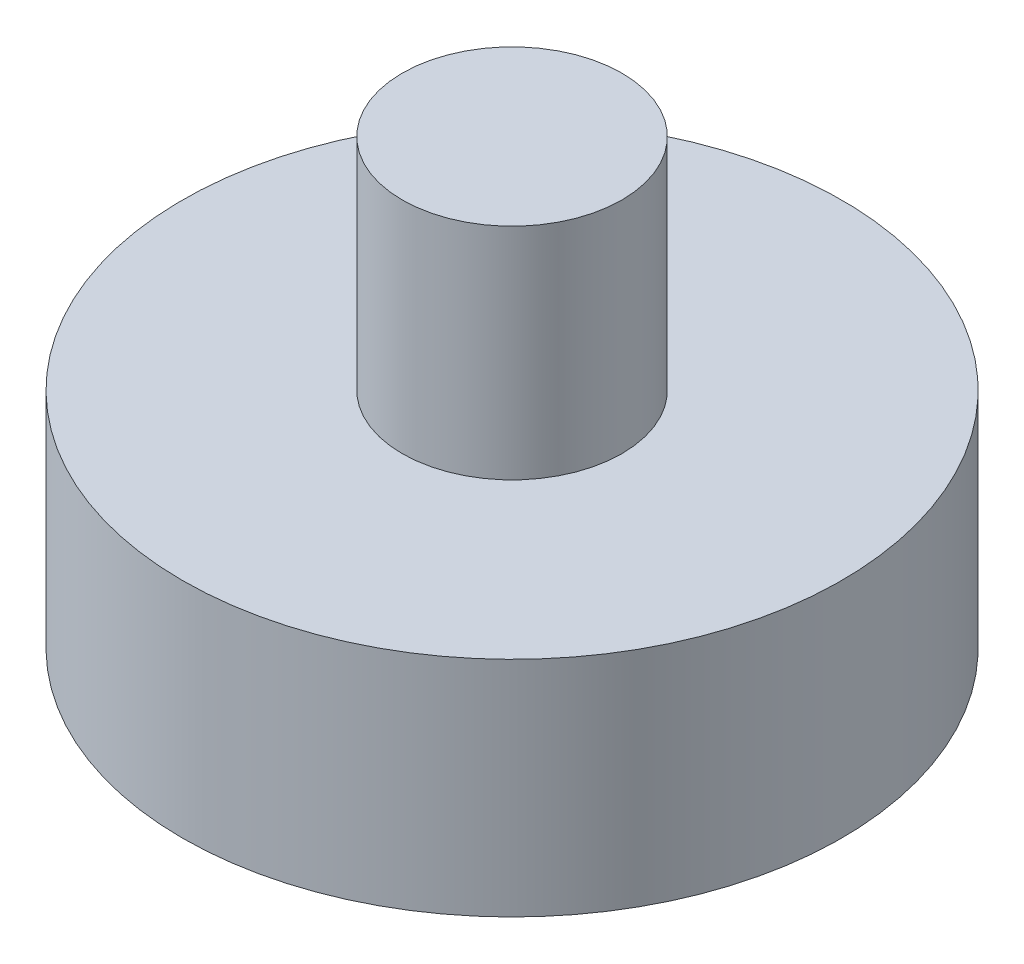
ISO-10303-21;
HEADER;
FILE_DESCRIPTION(('STEP AP214'),'2;1');
FILE_NAME('part.step','',(''),(''),'','','');
FILE_SCHEMA(('AUTOMOTIVE_DESIGN { 1 0 10303 214 1 1 1 1 }'));
ENDSEC;
DATA;
#1=APPLICATION_CONTEXT('core data for automotive mechanical design processes');
#2=APPLICATION_PROTOCOL_DEFINITION('international standard','automotive_design',2000,#1);
#3=PRODUCT_CONTEXT('',#1,'mechanical');
#4=PRODUCT('Part','Part','',(#3));
#5=PRODUCT_RELATED_PRODUCT_CATEGORY('part','',(#4));
#6=PRODUCT_DEFINITION_FORMATION('','',#4);
#7=PRODUCT_DEFINITION_CONTEXT('part definition',#1,'design');
#8=PRODUCT_DEFINITION('design','',#6,#7);
#9=PRODUCT_DEFINITION_SHAPE('','',#8);
#10=(LENGTH_UNIT() NAMED_UNIT(*) SI_UNIT(.MILLI.,.METRE.));
#11=(NAMED_UNIT(*) PLANE_ANGLE_UNIT() SI_UNIT($,.RADIAN.));
#12=(NAMED_UNIT(*) SI_UNIT($,.STERADIAN.) SOLID_ANGLE_UNIT());
#13=UNCERTAINTY_MEASURE_WITH_UNIT(LENGTH_MEASURE(1.E-05),#10,'distance_accuracy_value','');
#14=(GEOMETRIC_REPRESENTATION_CONTEXT(3) GLOBAL_UNCERTAINTY_ASSIGNED_CONTEXT((#13)) GLOBAL_UNIT_ASSIGNED_CONTEXT((#10,
#11,#12)) REPRESENTATION_CONTEXT('',''));
#15=CARTESIAN_POINT('',(0.,0.,0.));
#16=DIRECTION('',(0.,0.,1.));
#17=DIRECTION('',(1.,0.,0.));
#18=AXIS2_PLACEMENT_3D('',#15,#16,#17);
#19=CARTESIAN_POINT('',(0.,20.3125,0.));
#20=DIRECTION('',(0.,-1.,0.));
#21=DIRECTION('',(0.,0.,-1.));
#22=AXIS2_PLACEMENT_3D('',#19,#20,#21);
#23=CYLINDRICAL_SURFACE('',#22,60.);
#24=CARTESIAN_POINT('',(0.,20.3125,0.));
#25=DIRECTION('',(0.,1.,0.));
#26=DIRECTION('',(0.,0.,1.));
#27=AXIS2_PLACEMENT_3D('',#24,#25,#26);
#28=CIRCLE('',#27,60.);
#29=CARTESIAN_POINT('',(0.,20.3125,60.));
#30=VERTEX_POINT('',#29);
#31=EDGE_CURVE('E39',#30,#30,#28,.T.);
#32=ORIENTED_EDGE('',*,*,#31,.F.);
#33=EDGE_LOOP('',(#32));
#34=FACE_BOUND('',#33,.T.);
#35=CARTESIAN_POINT('',(0.,-20.3125,0.));
#36=DIRECTION('',(0.,1.,0.));
#37=DIRECTION('',(0.,0.,1.));
#38=AXIS2_PLACEMENT_3D('',#35,#36,#37);
#39=CIRCLE('',#38,60.);
#40=CARTESIAN_POINT('',(0.,-20.3125,60.));
#41=VERTEX_POINT('',#40);
#42=EDGE_CURVE('E35',#41,#41,#39,.T.);
#43=ORIENTED_EDGE('',*,*,#42,.T.);
#44=EDGE_LOOP('',(#43));
#45=FACE_BOUND('',#44,.T.);
#46=ADVANCED_FACE('F32',(#34,#45),#23,.T.);
#47=CARTESIAN_POINT('',(0.,20.3125,0.));
#48=DIRECTION('',(0.,1.,0.));
#49=DIRECTION('',(0.,0.,1.));
#50=AXIS2_PLACEMENT_3D('',#47,#48,#49);
#51=PLANE('',#50);
#52=CARTESIAN_POINT('',(0.,20.3125,0.));
#53=DIRECTION('',(0.,1.,0.));
#54=DIRECTION('',(0.,0.,1.));
#55=AXIS2_PLACEMENT_3D('',#52,#53,#54);
#56=CIRCLE('',#55,20.);
#57=CARTESIAN_POINT('',(0.,20.3125,20.));
#58=VERTEX_POINT('',#57);
#59=EDGE_CURVE('E10',#58,#58,#56,.T.);
#60=ORIENTED_EDGE('',*,*,#59,.F.);
#61=EDGE_LOOP('',(#60));
#62=FACE_BOUND('',#61,.T.);
#63=ORIENTED_EDGE('',*,*,#31,.T.);
#64=EDGE_LOOP('',(#63));
#65=FACE_BOUND('',#64,.T.);
#66=ADVANCED_FACE('F56',(#62,#65),#51,.T.);
#67=CARTESIAN_POINT('',(0.,-20.3125,0.));
#68=DIRECTION('',(0.,1.,0.));
#69=DIRECTION('',(0.,0.,1.));
#70=AXIS2_PLACEMENT_3D('',#67,#68,#69);
#71=PLANE('',#70);
#72=ORIENTED_EDGE('',*,*,#42,.F.);
#73=EDGE_LOOP('',(#72));
#74=FACE_BOUND('',#73,.T.);
#75=ADVANCED_FACE('F53',(#74),#71,.F.);
#76=CARTESIAN_POINT('',(0.,60.3125,0.));
#77=DIRECTION('',(0.,-1.,0.));
#78=DIRECTION('',(0.,0.,-1.));
#79=AXIS2_PLACEMENT_3D('',#76,#77,#78);
#80=CYLINDRICAL_SURFACE('',#79,20.);
#81=CARTESIAN_POINT('',(0.,60.3125,0.));
#82=DIRECTION('',(0.,1.,0.));
#83=DIRECTION('',(0.,0.,1.));
#84=AXIS2_PLACEMENT_3D('',#81,#82,#83);
#85=CIRCLE('',#84,20.);
#86=CARTESIAN_POINT('',(0.,60.3125,20.));
#87=VERTEX_POINT('',#86);
#88=EDGE_CURVE('E45',#87,#87,#85,.T.);
#89=ORIENTED_EDGE('',*,*,#88,.F.);
#90=EDGE_LOOP('',(#89));
#91=FACE_BOUND('',#90,.T.);
#92=ORIENTED_EDGE('',*,*,#59,.T.);
#93=EDGE_LOOP('',(#92));
#94=FACE_BOUND('',#93,.T.);
#95=ADVANCED_FACE('F55',(#91,#94),#80,.T.);
#96=CARTESIAN_POINT('',(0.,60.3125,0.));
#97=DIRECTION('',(0.,1.,0.));
#98=DIRECTION('',(0.,0.,1.));
#99=AXIS2_PLACEMENT_3D('',#96,#97,#98);
#100=PLANE('',#99);
#101=ORIENTED_EDGE('',*,*,#88,.T.);
#102=EDGE_LOOP('',(#101));
#103=FACE_BOUND('',#102,.T.);
#104=ADVANCED_FACE('F61',(#103),#100,.T.);
#105=CLOSED_SHELL('',(#46,#66,#75,#95,#104));
#106=MANIFOLD_SOLID_BREP('B2',#105);
#107=ADVANCED_BREP_SHAPE_REPRESENTATION('',(#18,#106),#14);
#108=SHAPE_DEFINITION_REPRESENTATION(#9,#107);
ENDSEC;
END-ISO-10303-21;
